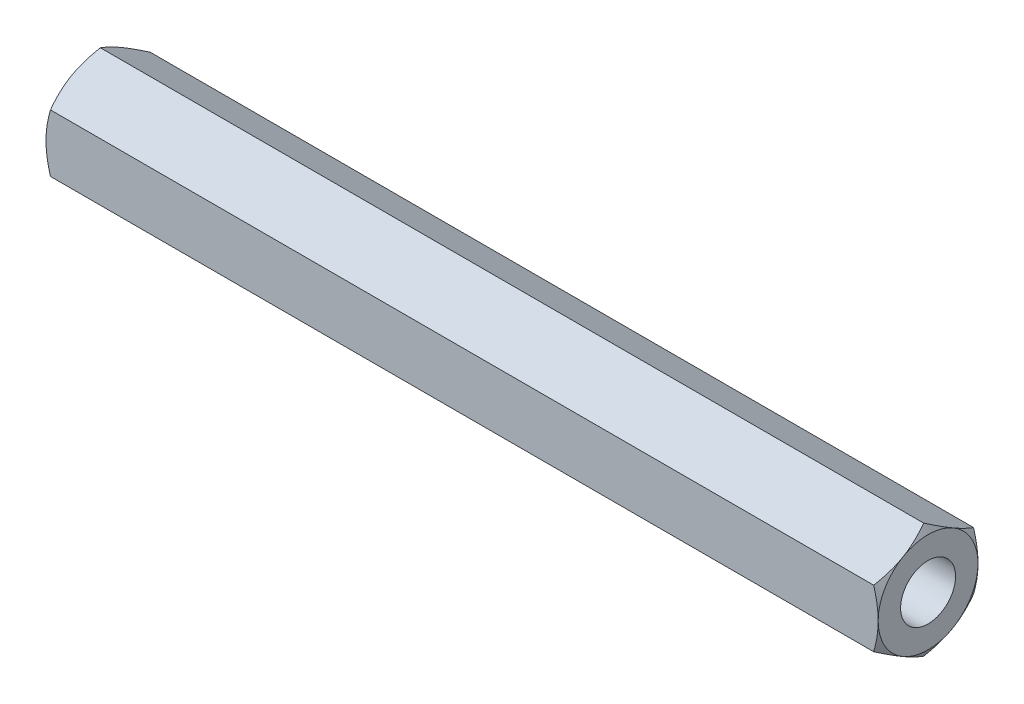
ISO-10303-21;
HEADER;
FILE_DESCRIPTION(('STEP AP214'),'2;1');
FILE_NAME('part.step','',(''),(''),'','','');
FILE_SCHEMA(('AUTOMOTIVE_DESIGN { 1 0 10303 214 1 1 1 1 }'));
ENDSEC;
DATA;
#1=APPLICATION_CONTEXT('core data for automotive mechanical design processes');
#2=APPLICATION_PROTOCOL_DEFINITION('international standard','automotive_design',2000,#1);
#3=PRODUCT_CONTEXT('',#1,'mechanical');
#4=PRODUCT('Part','Part','',(#3));
#5=PRODUCT_RELATED_PRODUCT_CATEGORY('part','',(#4));
#6=PRODUCT_DEFINITION_FORMATION('','',#4);
#7=PRODUCT_DEFINITION_CONTEXT('part definition',#1,'design');
#8=PRODUCT_DEFINITION('design','',#6,#7);
#9=PRODUCT_DEFINITION_SHAPE('','',#8);
#10=(LENGTH_UNIT() NAMED_UNIT(*) SI_UNIT(.MILLI.,.METRE.));
#11=(NAMED_UNIT(*) PLANE_ANGLE_UNIT() SI_UNIT($,.RADIAN.));
#12=(NAMED_UNIT(*) SI_UNIT($,.STERADIAN.) SOLID_ANGLE_UNIT());
#13=UNCERTAINTY_MEASURE_WITH_UNIT(LENGTH_MEASURE(1.E-05),#10,'distance_accuracy_value','');
#14=(GEOMETRIC_REPRESENTATION_CONTEXT(3) GLOBAL_UNCERTAINTY_ASSIGNED_CONTEXT((#13)) GLOBAL_UNIT_ASSIGNED_CONTEXT((#10,
#11,#12)) REPRESENTATION_CONTEXT('',''));
#15=CARTESIAN_POINT('',(0.,0.,0.));
#16=DIRECTION('',(0.,0.,1.));
#17=DIRECTION('',(1.,0.,0.));
#18=AXIS2_PLACEMENT_3D('',#15,#16,#17);
#19=CARTESIAN_POINT('',(50.,-1.73205080756888,3.));
#20=DIRECTION('',(0.,0.866025403784439,-0.499999999999999));
#21=DIRECTION('',(0.,0.499999999999999,0.866025403784439));
#22=AXIS2_PLACEMENT_3D('',#19,#20,#21);
#23=PLANE('',#22);
#24=CARTESIAN_POINT('',(0.268015862431012,-3.4642170851916,-0.000199999999998663));
#25=CARTESIAN_POINT('',(0.224053704452308,-3.38810199317915,0.131635206588334));
#26=CARTESIAN_POINT('',(0.18407158629263,-3.31132988107607,0.264608405355251));
#27=CARTESIAN_POINT('',(0.114282080445467,-3.15645624025988,0.532857420002058));
#28=CARTESIAN_POINT('',(0.0844993822653816,-3.078351959461,0.668138002634344));
#29=CARTESIAN_POINT('',(0.0381378392112558,-2.92311136358059,0.937022602096486));
#30=CARTESIAN_POINT('',(0.0212504411229507,-2.84599893549862,1.07058524542946));
#31=CARTESIAN_POINT('',(0.00108964244852522,-2.6914112001411,1.3383390572957));
#32=CARTESIAN_POINT('',(-0.00220045221891811,-2.61393645482892,1.47252925247985));
#33=CARTESIAN_POINT('',(0.00464053088539217,-2.46916798492017,1.72327559769581));
#34=CARTESIAN_POINT('',(0.0130919141926184,-2.40185259973206,1.83986926497268));
#35=CARTESIAN_POINT('',(0.0398789430070373,-2.2676603930218,2.07229698497464));
#36=CARTESIAN_POINT('',(0.0582237408617146,-2.2007840357172,2.18813023365133));
#37=CARTESIAN_POINT('',(0.10408475085333,-2.06631510305815,2.42103725705637));
#38=CARTESIAN_POINT('',(0.131795385263085,-1.99873954872331,2.53808155051394));
#39=CARTESIAN_POINT('',(0.194687795137403,-1.8645963706076,2.77042435049913));
#40=CARTESIAN_POINT('',(0.229854791021559,-1.79802702797161,2.88572583417111));
#41=CARTESIAN_POINT('',(0.268015862431013,-1.73193533751504,3.0002));
#42=B_SPLINE_CURVE_WITH_KNOTS('',3,(#24,#25,#26,#27,#28,#29,#30,#31,#32,#33,#34,#35,#36,#37,#38,
#39,#40,#41),.UNSPECIFIED.,.F.,.F.,(4,2,2,2,2,2,2,2,4),(0.,0.475539830103042,0.952222784107966,
1.41710776961288,1.88142182298026,2.28572436316091,2.69040156475039,3.10405572063576,
3.5168974940707),.UNSPECIFIED.);
#43=CARTESIAN_POINT('',(0.,-2.59807621135332,1.5));
#44=VERTEX_POINT('',#43);
#45=CARTESIAN_POINT('',(0.267949192431119,-1.73205080756886,3.));
#46=VERTEX_POINT('',#45);
#47=EDGE_CURVE('E225',#44,#46,#42,.T.);
#48=ORIENTED_EDGE('',*,*,#47,.F.);
#49=CARTESIAN_POINT('',(0.267949192431119,-3.46410161513775,0.));
#50=VERTEX_POINT('',#49);
#51=EDGE_CURVE('E339',#50,#44,#42,.T.);
#52=ORIENTED_EDGE('',*,*,#51,.F.);
#53=DIRECTION('',(-1.,0.,0.));
#54=VECTOR('',#53,1.);
#55=CARTESIAN_POINT('',(50.,-3.46410161513776,0.));
#56=LINE('',#55,#54);
#57=CARTESIAN_POINT('',(49.7320508075689,-3.46410161513775,0.));
#58=VERTEX_POINT('',#57);
#59=EDGE_CURVE('E303',#58,#50,#56,.T.);
#60=ORIENTED_EDGE('',*,*,#59,.F.);
#61=CARTESIAN_POINT('',(49.731984137569,-1.73193533751504,3.0002));
#62=CARTESIAN_POINT('',(49.7759462955477,-1.80805042952749,2.86836479341167));
#63=CARTESIAN_POINT('',(49.8159284137074,-1.88482254163057,2.73539159464475));
#64=CARTESIAN_POINT('',(49.8857179195545,-2.03969618244676,2.46714257999795));
#65=CARTESIAN_POINT('',(49.9155006177346,-2.11780046324564,2.33186199736566));
#66=CARTESIAN_POINT('',(49.9618621607887,-2.27304105912605,2.06297739790352));
#67=CARTESIAN_POINT('',(49.978749558877,-2.35015348720802,1.92941475457054));
#68=CARTESIAN_POINT('',(49.9989103575515,-2.50474122256554,1.66166094270431));
#69=CARTESIAN_POINT('',(50.0022004522189,-2.58221596787772,1.52747074752016));
#70=CARTESIAN_POINT('',(49.9953594691146,-2.72698443778647,1.2767244023042));
#71=CARTESIAN_POINT('',(49.9869080858074,-2.79429982297457,1.16013073502733));
#72=CARTESIAN_POINT('',(49.960121056993,-2.92849202968484,0.927703015025365));
#73=CARTESIAN_POINT('',(49.9417762591383,-2.99536838698944,0.811869766348671));
#74=CARTESIAN_POINT('',(49.8959152491467,-3.12983731964849,0.578962742943634));
#75=CARTESIAN_POINT('',(49.8682046147369,-3.19741287398333,0.46191844948606));
#76=CARTESIAN_POINT('',(49.8053122048626,-3.33155605209905,0.229575649500875));
#77=CARTESIAN_POINT('',(49.7701452089784,-3.39812539473503,0.114274165828893));
#78=CARTESIAN_POINT('',(49.731984137569,-3.4642170851916,-0.000199999999999578));
#79=B_SPLINE_CURVE_WITH_KNOTS('',3,(#61,#62,#63,#64,#65,#66,#67,#68,#69,#70,#71,#72,#73,#74,#75,
#76,#77,#78),.UNSPECIFIED.,.F.,.F.,(4,2,2,2,2,2,2,2,4),(0.,0.475539830103041,0.952222784107964,
1.41710776961288,1.88142182298026,2.28572436316091,2.69040156475039,3.10405572063577,
3.51689749407071),.UNSPECIFIED.);
#80=CARTESIAN_POINT('',(50.,-2.59807621135332,1.5));
#81=VERTEX_POINT('',#80);
#82=EDGE_CURVE('E272',#81,#58,#79,.T.);
#83=ORIENTED_EDGE('',*,*,#82,.F.);
#84=CARTESIAN_POINT('',(49.7320508075689,-1.73205080756887,3.));
#85=VERTEX_POINT('',#84);
#86=EDGE_CURVE('E277',#85,#81,#79,.T.);
#87=ORIENTED_EDGE('',*,*,#86,.F.);
#88=DIRECTION('',(-1.,0.,0.));
#89=VECTOR('',#88,1.);
#90=CARTESIAN_POINT('',(50.,-1.73205080756888,3.));
#91=LINE('',#90,#89);
#92=EDGE_CURVE('E342',#85,#46,#91,.T.);
#93=ORIENTED_EDGE('',*,*,#92,.T.);
#94=EDGE_LOOP('',(#48,#52,#60,#83,#87,#93));
#95=FACE_BOUND('',#94,.T.);
#96=ADVANCED_FACE('F47',(#95),#23,.F.);
#97=CARTESIAN_POINT('',(50.,-3.46410161513776,0.));
#98=DIRECTION('',(0.,0.866025403784439,0.499999999999999));
#99=DIRECTION('',(0.,-0.499999999999999,0.866025403784439));
#100=AXIS2_PLACEMENT_3D('',#97,#98,#99);
#101=PLANE('',#100);
#102=CARTESIAN_POINT('',(0.268015862431008,-1.73193533751505,-3.00019999999999));
#103=CARTESIAN_POINT('',(0.224053704452304,-1.80805042952749,-2.86836479341166));
#104=CARTESIAN_POINT('',(0.184071586292626,-1.88482254163058,-2.73539159464474));
#105=CARTESIAN_POINT('',(0.114282080445464,-2.03969618244676,-2.46714257999793));
#106=CARTESIAN_POINT('',(0.0844993822653792,-2.11780046324564,-2.33186199736565));
#107=CARTESIAN_POINT('',(0.038137839211254,-2.27304105912606,-2.06297739790351));
#108=CARTESIAN_POINT('',(0.0212504411229492,-2.35015348720803,-1.92941475457053));
#109=CARTESIAN_POINT('',(0.00108964244852425,-2.50474122256554,-1.6616609427043));
#110=CARTESIAN_POINT('',(-0.00220045221891878,-2.58221596787772,-1.52747074752015));
#111=CARTESIAN_POINT('',(0.0046405308853918,-2.72698443778647,-1.27672440230418));
#112=CARTESIAN_POINT('',(0.013091914192618,-2.79429982297458,-1.16013073502731));
#113=CARTESIAN_POINT('',(0.0398789430070372,-2.92849202968484,-0.927703015025355));
#114=CARTESIAN_POINT('',(0.0582237408617145,-2.99536838698944,-0.811869766348661));
#115=CARTESIAN_POINT('',(0.10408475085333,-3.12983731964849,-0.578962742943627));
#116=CARTESIAN_POINT('',(0.131795385263085,-3.19741287398333,-0.461918449486054));
#117=CARTESIAN_POINT('',(0.194687795137403,-3.33155605209905,-0.229575649500872));
#118=CARTESIAN_POINT('',(0.229854791021558,-3.39812539473503,-0.114274165828891));
#119=CARTESIAN_POINT('',(0.268015862431012,-3.4642170851916,0.00020000000000122));
#120=B_SPLINE_CURVE_WITH_KNOTS('',3,(#102,#103,#104,#105,#106,#107,#108,#109,#110,#111,#112,
#113,#114,#115,#116,#117,#118,#119),.UNSPECIFIED.,.F.,.F.,(4,2,2,2,2,2,2,2,4),(0.,
0.47553983010304,0.952222784107964,1.41710776961288,1.88142182298026,2.28572436316091,
2.69040156475038,3.10405572063575,3.51689749407069),.UNSPECIFIED.);
#121=CARTESIAN_POINT('',(0.,-2.59807621135332,-1.5));
#122=VERTEX_POINT('',#121);
#123=EDGE_CURVE('E237',#122,#50,#120,.T.);
#124=ORIENTED_EDGE('',*,*,#123,.F.);
#125=CARTESIAN_POINT('',(0.267949192431119,-1.73205080756889,-2.99999999999999));
#126=VERTEX_POINT('',#125);
#127=EDGE_CURVE('E243',#126,#122,#120,.T.);
#128=ORIENTED_EDGE('',*,*,#127,.F.);
#129=DIRECTION('',(-1.,0.,0.));
#130=VECTOR('',#129,1.);
#131=CARTESIAN_POINT('',(50.,-1.73205080756889,-2.99999999999999));
#132=LINE('',#131,#130);
#133=CARTESIAN_POINT('',(49.7320508075689,-1.73205080756889,-2.99999999999999));
#134=VERTEX_POINT('',#133);
#135=EDGE_CURVE('E298',#134,#126,#132,.T.);
#136=ORIENTED_EDGE('',*,*,#135,.F.);
#137=CARTESIAN_POINT('',(49.731984137569,-3.4642170851916,0.000200000000002223));
#138=CARTESIAN_POINT('',(49.7759462955477,-3.38810199317915,-0.13163520658833));
#139=CARTESIAN_POINT('',(49.8159284137074,-3.31132988107607,-0.264608405355247));
#140=CARTESIAN_POINT('',(49.8857179195545,-3.15645624025988,-0.532857420002053));
#141=CARTESIAN_POINT('',(49.9155006177346,-3.078351959461,-0.668138002634339));
#142=CARTESIAN_POINT('',(49.9618621607887,-2.92311136358059,-0.93702260209648));
#143=CARTESIAN_POINT('',(49.978749558877,-2.84599893549862,-1.07058524542946));
#144=CARTESIAN_POINT('',(49.9989103575515,-2.6914112001411,-1.33833905729569));
#145=CARTESIAN_POINT('',(50.0022004522189,-2.61393645482892,-1.47252925247984));
#146=CARTESIAN_POINT('',(49.9953594691146,-2.46916798492017,-1.7232755976958));
#147=CARTESIAN_POINT('',(49.9869080858074,-2.40185259973207,-1.83986926497267));
#148=CARTESIAN_POINT('',(49.960121056993,-2.26766039302181,-2.07229698497463));
#149=CARTESIAN_POINT('',(49.9417762591383,-2.20078403571721,-2.18813023365133));
#150=CARTESIAN_POINT('',(49.8959152491467,-2.06631510305816,-2.42103725705636));
#151=CARTESIAN_POINT('',(49.8682046147369,-1.99873954872332,-2.53808155051393));
#152=CARTESIAN_POINT('',(49.8053122048626,-1.8645963706076,-2.77042435049912));
#153=CARTESIAN_POINT('',(49.7701452089784,-1.79802702797162,-2.8857258341711));
#154=CARTESIAN_POINT('',(49.731984137569,-1.73193533751505,-3.00019999999999));
#155=B_SPLINE_CURVE_WITH_KNOTS('',3,(#137,#138,#139,#140,#141,#142,#143,#144,#145,#146,#147,
#148,#149,#150,#151,#152,#153,#154),.UNSPECIFIED.,.F.,.F.,(4,2,2,2,2,2,2,2,4),(0.,
0.47553983010304,0.952222784107964,1.41710776961288,1.88142182298026,2.28572436316091,
2.69040156475038,3.10405572063576,3.51689749407069),.UNSPECIFIED.);
#156=CARTESIAN_POINT('',(50.,-2.59807621135332,-1.5));
#157=VERTEX_POINT('',#156);
#158=EDGE_CURVE('E259',#157,#134,#155,.T.);
#159=ORIENTED_EDGE('',*,*,#158,.F.);
#160=EDGE_CURVE('E265',#58,#157,#155,.T.);
#161=ORIENTED_EDGE('',*,*,#160,.F.);
#162=ORIENTED_EDGE('',*,*,#59,.T.);
#163=EDGE_LOOP('',(#124,#128,#136,#159,#161,#162));
#164=FACE_BOUND('',#163,.T.);
#165=ADVANCED_FACE('F251',(#164),#101,.F.);
#166=CARTESIAN_POINT('',(50.,-1.73205080756889,-2.99999999999999));
#167=DIRECTION('',(0.,0.,1.));
#168=DIRECTION('',(0.,-1.,0.));
#169=AXIS2_PLACEMENT_3D('',#166,#167,#168);
#170=PLANE('',#169);
#171=CARTESIAN_POINT('',(1.43558063355249,-4.5936550632739,-2.99999999999999));
#172=CARTESIAN_POINT('',(1.37192769854955,-4.46193806193921,-2.99999999999999));
#173=CARTESIAN_POINT('',(1.3089075261953,-4.32990963818021,-2.99999999999999));
#174=CARTESIAN_POINT('',(1.18449428928628,-4.06506155981042,-2.99999999999999));
#175=CARTESIAN_POINT('',(1.12310150644712,-3.93224177301897,-2.99999999999999));
#176=CARTESIAN_POINT('',(1.00198121042108,-3.66492510058907,-2.99999999999999));
#177=CARTESIAN_POINT('',(0.942265237401318,-3.53042296718751,-2.99999999999999));
#178=CARTESIAN_POINT('',(0.825398236528266,-3.26031321099484,-2.99999999999999));
#179=CARTESIAN_POINT('',(0.768247074976145,-3.12470564626428,-2.99999999999999));
#180=CARTESIAN_POINT('',(0.656513220776866,-2.85048588685443,-2.99999999999999));
#181=CARTESIAN_POINT('',(0.601970674908428,-2.71185724371338,-2.99999999999999));
#182=CARTESIAN_POINT('',(0.49715734367469,-2.43296482040768,-2.99999999999999));
#183=CARTESIAN_POINT('',(0.446887033573552,-2.29270086029106,-2.99999999999999));
#184=CARTESIAN_POINT('',(0.351968923605783,-2.01060273748632,-2.99999999999999));
#185=CARTESIAN_POINT('',(0.307309170304389,-1.86877263831547,-2.99999999999999));
#186=CARTESIAN_POINT('',(0.225062578549613,-1.5830961389059,-2.99999999999999));
#187=CARTESIAN_POINT('',(0.187473503387639,-1.43925039181264,-2.99999999999999));
#188=CARTESIAN_POINT('',(0.121193111976194,-1.14944432791498,-2.99999999999999));
#189=CARTESIAN_POINT('',(0.0925041661926663,-1.00348345858388,-2.99999999999999));
#190=CARTESIAN_POINT('',(0.0459556604077279,-0.709801932641903,-2.99999999999999));
#191=CARTESIAN_POINT('',(0.0280961099738148,-0.562081274476403,-2.99999999999999));
#192=CARTESIAN_POINT('',(0.00478634221370155,-0.266588683448616,-2.99999999999999));
#193=CARTESIAN_POINT('',(-0.000742435968470097,-0.118823109094487,-2.99999999999999));
#194=CARTESIAN_POINT('',(0.000903065061568725,0.176604568225066,-2.99999999999998));
#195=CARTESIAN_POINT('',(0.0080740468219427,0.324266688093653,-2.99999999999998));
#196=CARTESIAN_POINT('',(0.0306591215677418,0.576421127047397,-2.99999999999998));
#197=CARTESIAN_POINT('',(0.0431320574085226,0.681191633058682,-2.99999999999998));
#198=CARTESIAN_POINT('',(0.0736601734850352,0.889923323753434,-2.99999999999998));
#199=CARTESIAN_POINT('',(0.0917162341003719,0.993884378145506,-2.99999999999998));
#200=CARTESIAN_POINT('',(0.15331148164255,1.30446861725753,-2.99999999999998));
#201=CARTESIAN_POINT('',(0.204261875138217,1.50963598921605,-2.99999999999998));
#202=CARTESIAN_POINT('',(0.292137526979816,1.8166377585116,-2.99999999999998));
#203=CARTESIAN_POINT('',(0.323785729688481,1.9200724007783,-2.99999999999998));
#204=CARTESIAN_POINT('',(0.390213739719305,2.12586210546061,-2.99999999999998));
#205=CARTESIAN_POINT('',(0.424991387069349,2.22821785884626,-2.99999999999998));
#206=CARTESIAN_POINT('',(0.496954624473532,2.43142176673502,-2.99999999999998));
#207=CARTESIAN_POINT('',(0.534125559182345,2.5322751641883,-2.99999999999998));
#208=CARTESIAN_POINT('',(0.610649159322931,2.73319947171952,-2.99999999999998));
#209=CARTESIAN_POINT('',(0.650002706536684,2.83327004662892,-2.99999999999998));
#210=CARTESIAN_POINT('',(0.690232177334533,2.93297878902283,-2.99999999999998));
#211=B_SPLINE_CURVE_WITH_KNOTS('',3,(#171,#172,#173,#174,#175,#176,#177,#178,#179,#180,#181,
#182,#183,#184,#185,#186,#187,#188,#189,#190,#191,#192,#193,#194,#195,#196,#197,#198,#199,#200,
#201,#202,#203,#204,#205,#206,#207,#208,#209,#210),.UNSPECIFIED.,.F.,.F.,(4,2,2,2,2,2,2,2,2,2,2,
2,2,2,2,2,2,2,2,4),(0.,0.438878972321587,0.877833428815442,1.31929984513467,1.76074322183933,
2.20760615360299,2.65451873166517,3.10046239380698,3.54626474989472,3.99218573952054,
4.43810712310573,4.88117927184296,5.32413639518722,5.64051293969398,5.95693939775843,
6.59026325136604,6.91474174356255,7.23899797076879,7.56142906579427,7.88399138651427),.UNSPECIFIED.);
#212=CARTESIAN_POINT('',(0.,0.,-3.));
#213=VERTEX_POINT('',#212);
#214=EDGE_CURVE('E244',#213,#126,#211,.F.);
#215=ORIENTED_EDGE('',*,*,#214,.F.);
#216=CARTESIAN_POINT('',(0.267949192431119,1.73205080756888,-2.99999999999999));
#217=VERTEX_POINT('',#216);
#218=EDGE_CURVE('E351',#217,#213,#211,.F.);
#219=ORIENTED_EDGE('',*,*,#218,.F.);
#220=DIRECTION('',(-1.,0.,0.));
#221=VECTOR('',#220,1.);
#222=CARTESIAN_POINT('',(50.,1.73205080756889,-2.99999999999998));
#223=LINE('',#222,#221);
#224=CARTESIAN_POINT('',(49.7320508075689,1.73205080756888,-2.99999999999999));
#225=VERTEX_POINT('',#224);
#226=EDGE_CURVE('E304',#225,#217,#223,.T.);
#227=ORIENTED_EDGE('',*,*,#226,.F.);
#228=CARTESIAN_POINT('',(48.5644193664475,-4.59365506327389,-2.99999999999999));
#229=CARTESIAN_POINT('',(48.6280723014505,-4.46193806193921,-2.99999999999999));
#230=CARTESIAN_POINT('',(48.6910924738047,-4.32990963818021,-2.99999999999999));
#231=CARTESIAN_POINT('',(48.8155057107137,-4.06506155981041,-2.99999999999999));
#232=CARTESIAN_POINT('',(48.8768984935529,-3.93224177301896,-2.99999999999999));
#233=CARTESIAN_POINT('',(48.9980187895789,-3.66492510058907,-2.99999999999999));
#234=CARTESIAN_POINT('',(49.0577347625987,-3.5304229671875,-2.99999999999999));
#235=CARTESIAN_POINT('',(49.1746017634717,-3.26031321099483,-2.99999999999999));
#236=CARTESIAN_POINT('',(49.2317529250239,-3.12470564626427,-2.99999999999999));
#237=CARTESIAN_POINT('',(49.3434867792231,-2.85048588685443,-2.99999999999999));
#238=CARTESIAN_POINT('',(49.3980293250916,-2.71185724371337,-2.99999999999999));
#239=CARTESIAN_POINT('',(49.5028426563253,-2.43296482040768,-2.99999999999999));
#240=CARTESIAN_POINT('',(49.5531129664265,-2.29270086029106,-2.99999999999999));
#241=CARTESIAN_POINT('',(49.6480310763942,-2.01060273748632,-2.99999999999999));
#242=CARTESIAN_POINT('',(49.6926908296956,-1.86877263831547,-2.99999999999999));
#243=CARTESIAN_POINT('',(49.7749374214504,-1.5830961389059,-2.99999999999999));
#244=CARTESIAN_POINT('',(49.8125264966124,-1.43925039181264,-2.99999999999999));
#245=CARTESIAN_POINT('',(49.8788068880238,-1.14944432791498,-2.99999999999999));
#246=CARTESIAN_POINT('',(49.9074958338073,-1.00348345858388,-2.99999999999999));
#247=CARTESIAN_POINT('',(49.9540443395923,-0.709801932641903,-2.99999999999999));
#248=CARTESIAN_POINT('',(49.9719038900262,-0.562081274476404,-2.99999999999999));
#249=CARTESIAN_POINT('',(49.9952136577863,-0.266588683448618,-2.99999999999999));
#250=CARTESIAN_POINT('',(50.0007424359685,-0.118823109094489,-2.99999999999999));
#251=CARTESIAN_POINT('',(49.9990969349384,0.176604568225062,-2.99999999999998));
#252=CARTESIAN_POINT('',(49.9919259531781,0.32426668809365,-2.99999999999998));
#253=CARTESIAN_POINT('',(49.9693408784323,0.576421127047393,-2.99999999999998));
#254=CARTESIAN_POINT('',(49.9568679425915,0.68119163305868,-2.99999999999998));
#255=CARTESIAN_POINT('',(49.926339826515,0.889923323753433,-2.99999999999998));
#256=CARTESIAN_POINT('',(49.9082837658996,0.993884378145507,-2.99999999999998));
#257=CARTESIAN_POINT('',(49.8466885183575,1.30446861725753,-2.99999999999998));
#258=CARTESIAN_POINT('',(49.7957381248618,1.50963598921606,-2.99999999999998));
#259=CARTESIAN_POINT('',(49.7078624730202,1.81663775851161,-2.99999999999998));
#260=CARTESIAN_POINT('',(49.6762142703115,1.92007240077832,-2.99999999999998));
#261=CARTESIAN_POINT('',(49.6097862602807,2.12586210546063,-2.99999999999998));
#262=CARTESIAN_POINT('',(49.5750086129307,2.22821785884628,-2.99999999999998));
#263=CARTESIAN_POINT('',(49.5030453755265,2.43142176673504,-2.99999999999998));
#264=CARTESIAN_POINT('',(49.4658744408177,2.53227516418832,-2.99999999999998));
#265=CARTESIAN_POINT('',(49.3893508406771,2.73319947171955,-2.99999999999998));
#266=CARTESIAN_POINT('',(49.3499972934633,2.83327004662895,-2.99999999999998));
#267=CARTESIAN_POINT('',(49.3097678226655,2.93297878902286,-2.99999999999998));
#268=B_SPLINE_CURVE_WITH_KNOTS('',3,(#228,#229,#230,#231,#232,#233,#234,#235,#236,#237,#238,
#239,#240,#241,#242,#243,#244,#245,#246,#247,#248,#249,#250,#251,#252,#253,#254,#255,#256,#257,
#258,#259,#260,#261,#262,#263,#264,#265,#266,#267),.UNSPECIFIED.,.F.,.F.,(4,2,2,2,2,2,2,2,2,2,2,
2,2,2,2,2,2,2,2,4),(0.,0.438878972321586,0.877833428815437,1.31929984513466,1.76074322183933,
2.20760615360298,2.65451873166515,3.10046239380697,3.54626474989471,3.99218573952053,
4.43810712310571,4.88117927184294,5.3241363951872,5.64051293969397,5.95693939775841,
6.59026325136604,6.91474174356256,7.2389979707688,7.56142906579428,7.88399138651428),.UNSPECIFIED.);
#269=CARTESIAN_POINT('',(50.,0.,-3.));
#270=VERTEX_POINT('',#269);
#271=EDGE_CURVE('E267',#270,#225,#268,.T.);
#272=ORIENTED_EDGE('',*,*,#271,.F.);
#273=EDGE_CURVE('E266',#134,#270,#268,.T.);
#274=ORIENTED_EDGE('',*,*,#273,.F.);
#275=ORIENTED_EDGE('',*,*,#135,.T.);
#276=EDGE_LOOP('',(#215,#219,#227,#272,#274,#275));
#277=FACE_BOUND('',#276,.T.);
#278=ADVANCED_FACE('F254',(#277),#170,.F.);
#279=CARTESIAN_POINT('',(50.,1.73205080756889,-2.99999999999998));
#280=DIRECTION('',(0.,-0.866025403784438,0.5));
#281=DIRECTION('',(0.,-0.5,-0.866025403784438));
#282=AXIS2_PLACEMENT_3D('',#279,#280,#281);
#283=PLANE('',#282);
#284=CARTESIAN_POINT('',(0.268015862431008,3.46421708519159,0.000199999999986678));
#285=CARTESIAN_POINT('',(0.224053704452304,3.38810199317914,-0.131635206588345));
#286=CARTESIAN_POINT('',(0.184071586292626,3.31132988107606,-0.264608405355262));
#287=CARTESIAN_POINT('',(0.114282080445464,3.15645624025987,-0.532857420002069));
#288=CARTESIAN_POINT('',(0.0844993822653787,3.07835195946099,-0.668138002634355));
#289=CARTESIAN_POINT('',(0.0381378392112535,2.92311136358058,-0.937022602096496));
#290=CARTESIAN_POINT('',(0.0212504411229487,2.84599893549861,-1.07058524542947));
#291=CARTESIAN_POINT('',(0.00108964244852383,2.69141120014109,-1.3383390572957));
#292=CARTESIAN_POINT('',(-0.0022004522189192,2.61393645482891,-1.47252925247986));
#293=CARTESIAN_POINT('',(0.0046405308853912,2.46916798492016,-1.72327559769582));
#294=CARTESIAN_POINT('',(0.0130919141926171,2.40185259973206,-1.83986926497268));
#295=CARTESIAN_POINT('',(0.0398789430070354,2.2676603930218,-2.07229698497464));
#296=CARTESIAN_POINT('',(0.0582237408617123,2.2007840357172,-2.18813023365133));
#297=CARTESIAN_POINT('',(0.104084750853326,2.06631510305815,-2.42103725705636));
#298=CARTESIAN_POINT('',(0.131795385263081,1.99873954872331,-2.53808155051393));
#299=CARTESIAN_POINT('',(0.194687795137397,1.8645963706076,-2.77042435049911));
#300=CARTESIAN_POINT('',(0.229854791021552,1.79802702797162,-2.88572583417109));
#301=CARTESIAN_POINT('',(0.268015862431005,1.73193533751505,-3.00019999999998));
#302=B_SPLINE_CURVE_WITH_KNOTS('',3,(#284,#285,#286,#287,#288,#289,#290,#291,#292,#293,#294,
#295,#296,#297,#298,#299,#300,#301),.UNSPECIFIED.,.F.,.F.,(4,2,2,2,2,2,2,2,4),(0.,
0.475539830103041,0.952222784107964,1.41710776961288,1.88142182298026,2.2857243631609,
2.69040156475037,3.10405572063574,3.51689749407067),.UNSPECIFIED.);
#303=CARTESIAN_POINT('',(0.,2.59807621135332,-1.5));
#304=VERTEX_POINT('',#303);
#305=EDGE_CURVE('E348',#304,#217,#302,.T.);
#306=ORIENTED_EDGE('',*,*,#305,.F.);
#307=CARTESIAN_POINT('',(0.267949192431119,3.46410161513775,0.));
#308=VERTEX_POINT('',#307);
#309=EDGE_CURVE('E231',#308,#304,#302,.T.);
#310=ORIENTED_EDGE('',*,*,#309,.F.);
#311=DIRECTION('',(-1.,0.,0.));
#312=VECTOR('',#311,1.);
#313=CARTESIAN_POINT('',(50.,3.46410161513775,0.));
#314=LINE('',#313,#312);
#315=CARTESIAN_POINT('',(49.7320508075689,3.46410161513775,0.));
#316=VERTEX_POINT('',#315);
#317=EDGE_CURVE('E308',#316,#308,#314,.T.);
#318=ORIENTED_EDGE('',*,*,#317,.F.);
#319=CARTESIAN_POINT('',(49.731984137569,1.73193533751505,-3.00019999999998));
#320=CARTESIAN_POINT('',(49.7759462955477,1.80805042952749,-2.86836479341165));
#321=CARTESIAN_POINT('',(49.8159284137074,1.88482254163058,-2.73539159464474));
#322=CARTESIAN_POINT('',(49.8857179195545,2.03969618244676,-2.46714257999793));
#323=CARTESIAN_POINT('',(49.9155006177346,2.11780046324564,-2.33186199736564));
#324=CARTESIAN_POINT('',(49.9618621607887,2.27304105912606,-2.0629773979035));
#325=CARTESIAN_POINT('',(49.978749558877,2.35015348720803,-1.92941475457053));
#326=CARTESIAN_POINT('',(49.9989103575515,2.50474122256554,-1.6616609427043));
#327=CARTESIAN_POINT('',(50.0022004522189,2.58221596787772,-1.52747074752015));
#328=CARTESIAN_POINT('',(49.9953594691146,2.72698443778647,-1.27672440230418));
#329=CARTESIAN_POINT('',(49.9869080858074,2.79429982297458,-1.16013073502732));
#330=CARTESIAN_POINT('',(49.960121056993,2.92849202968484,-0.927703015025361));
#331=CARTESIAN_POINT('',(49.9417762591383,2.99536838698944,-0.811869766348668));
#332=CARTESIAN_POINT('',(49.8959152491467,3.12983731964849,-0.578962742943636));
#333=CARTESIAN_POINT('',(49.8682046147369,3.19741287398332,-0.461918449486064));
#334=CARTESIAN_POINT('',(49.8053122048626,3.33155605209904,-0.229575649500885));
#335=CARTESIAN_POINT('',(49.7701452089784,3.39812539473502,-0.114274165828905));
#336=CARTESIAN_POINT('',(49.731984137569,3.46421708519159,0.000199999999986781));
#337=B_SPLINE_CURVE_WITH_KNOTS('',3,(#319,#320,#321,#322,#323,#324,#325,#326,#327,#328,#329,
#330,#331,#332,#333,#334,#335,#336),.UNSPECIFIED.,.F.,.F.,(4,2,2,2,2,2,2,2,4),(0.,
0.475539830103039,0.952222784107961,1.41710776961287,1.88142182298025,2.2857243631609,
2.69040156475037,3.10405572063573,3.51689749407067),.UNSPECIFIED.);
#338=CARTESIAN_POINT('',(50.,2.59807621135332,-1.5));
#339=VERTEX_POINT('',#338);
#340=EDGE_CURVE('E364',#339,#316,#337,.T.);
#341=ORIENTED_EDGE('',*,*,#340,.F.);
#342=EDGE_CURVE('E365',#225,#339,#337,.T.);
#343=ORIENTED_EDGE('',*,*,#342,.F.);
#344=ORIENTED_EDGE('',*,*,#226,.T.);
#345=EDGE_LOOP('',(#306,#310,#318,#341,#343,#344));
#346=FACE_BOUND('',#345,.T.);
#347=ADVANCED_FACE('F362',(#346),#283,.F.);
#348=CARTESIAN_POINT('',(50.,3.46410161513775,0.));
#349=DIRECTION('',(0.,-0.866025403784439,-0.5));
#350=DIRECTION('',(0.,0.5,-0.866025403784439));
#351=AXIS2_PLACEMENT_3D('',#348,#349,#350);
#352=PLANE('',#351);
#353=CARTESIAN_POINT('',(0.268015862431008,1.73193533751503,3.0002));
#354=CARTESIAN_POINT('',(0.224053704452304,1.80805042952747,2.86836479341167));
#355=CARTESIAN_POINT('',(0.184071586292626,1.88482254163056,2.73539159464475));
#356=CARTESIAN_POINT('',(0.114282080445462,2.03969618244674,2.46714257999795));
#357=CARTESIAN_POINT('',(0.084499382265376,2.11780046324562,2.33186199736566));
#358=CARTESIAN_POINT('',(0.0381378392112495,2.27304105912603,2.06297739790352));
#359=CARTESIAN_POINT('',(0.0212504411229441,2.350153487208,1.92941475457054));
#360=CARTESIAN_POINT('',(0.00108964244851772,2.50474122256552,1.66166094270431));
#361=CARTESIAN_POINT('',(-0.00220045221892613,2.5822159678777,1.52747074752016));
#362=CARTESIAN_POINT('',(0.00464053088538316,2.72698443778645,1.2767244023042));
#363=CARTESIAN_POINT('',(0.0130919141926091,2.79429982297456,1.16013073502733));
#364=CARTESIAN_POINT('',(0.0398789430070281,2.92849202968482,0.927703015025362));
#365=CARTESIAN_POINT('',(0.0582237408617056,2.99536838698942,0.811869766348665));
#366=CARTESIAN_POINT('',(0.104084750853321,3.12983731964848,0.578962742943626));
#367=CARTESIAN_POINT('',(0.131795385263077,3.19741287398332,0.461918449486051));
#368=CARTESIAN_POINT('',(0.194687795137397,3.33155605209904,0.229575649500865));
#369=CARTESIAN_POINT('',(0.229854791021553,3.39812539473502,0.114274165828882));
#370=CARTESIAN_POINT('',(0.268015862431008,3.46421708519159,-0.000200000000013592));
#371=B_SPLINE_CURVE_WITH_KNOTS('',3,(#353,#354,#355,#356,#357,#358,#359,#360,#361,#362,#363,
#364,#365,#366,#367,#368,#369,#370),.UNSPECIFIED.,.F.,.F.,(4,2,2,2,2,2,2,2,4),(0.,
0.47553983010304,0.952222784107964,1.41710776961288,1.88142182298026,2.28572436316091,
2.6904015647504,3.10405572063578,3.51689749407072),.UNSPECIFIED.);
#372=CARTESIAN_POINT('',(0.,2.59807621135332,1.5));
#373=VERTEX_POINT('',#372);
#374=EDGE_CURVE('E343',#373,#308,#371,.T.);
#375=ORIENTED_EDGE('',*,*,#374,.F.);
#376=CARTESIAN_POINT('',(0.267949192431119,1.73205080756886,3.));
#377=VERTEX_POINT('',#376);
#378=EDGE_CURVE('E206',#377,#373,#371,.T.);
#379=ORIENTED_EDGE('',*,*,#378,.F.);
#380=DIRECTION('',(-1.,0.,0.));
#381=VECTOR('',#380,1.);
#382=CARTESIAN_POINT('',(50.,1.73205080756886,3.));
#383=LINE('',#382,#381);
#384=CARTESIAN_POINT('',(49.7320508075689,1.73205080756887,3.));
#385=VERTEX_POINT('',#384);
#386=EDGE_CURVE('E353',#385,#377,#383,.T.);
#387=ORIENTED_EDGE('',*,*,#386,.F.);
#388=CARTESIAN_POINT('',(49.731984137569,3.46421708519159,-0.000200000000013524));
#389=CARTESIAN_POINT('',(49.7759462955477,3.38810199317914,0.131635206588318));
#390=CARTESIAN_POINT('',(49.8159284137074,3.31132988107606,0.264608405355236));
#391=CARTESIAN_POINT('',(49.8857179195545,3.15645624025987,0.532857420002042));
#392=CARTESIAN_POINT('',(49.9155006177346,3.078351959461,0.668138002634327));
#393=CARTESIAN_POINT('',(49.9618621607888,2.92311136358058,0.937022602096468));
#394=CARTESIAN_POINT('',(49.9787495588771,2.84599893549861,1.07058524542944));
#395=CARTESIAN_POINT('',(49.9989103575515,2.69141120014109,1.33833905729568));
#396=CARTESIAN_POINT('',(50.0022004522189,2.61393645482892,1.47252925247983));
#397=CARTESIAN_POINT('',(49.9953594691146,2.46916798492016,1.72327559769579));
#398=CARTESIAN_POINT('',(49.9869080858074,2.40185259973206,1.83986926497266));
#399=CARTESIAN_POINT('',(49.960121056993,2.26766039302179,2.07229698497463));
#400=CARTESIAN_POINT('',(49.9417762591383,2.20078403571719,2.18813023365132));
#401=CARTESIAN_POINT('',(49.8959152491467,2.06631510305814,2.42103725705636));
#402=CARTESIAN_POINT('',(49.8682046147369,1.9987395487233,2.53808155051394));
#403=CARTESIAN_POINT('',(49.8053122048626,1.86459637060758,2.77042435049912));
#404=CARTESIAN_POINT('',(49.7701452089785,1.7980270279716,2.88572583417111));
#405=CARTESIAN_POINT('',(49.731984137569,1.73193533751503,3.0002));
#406=B_SPLINE_CURVE_WITH_KNOTS('',3,(#388,#389,#390,#391,#392,#393,#394,#395,#396,#397,#398,
#399,#400,#401,#402,#403,#404,#405),.UNSPECIFIED.,.F.,.F.,(4,2,2,2,2,2,2,2,4),(0.,
0.475539830103041,0.952222784107964,1.41710776961288,1.88142182298025,2.28572436316091,
2.6904015647504,3.10405572063578,3.51689749407072),.UNSPECIFIED.);
#407=CARTESIAN_POINT('',(50.,2.59807621135332,1.5));
#408=VERTEX_POINT('',#407);
#409=EDGE_CURVE('E171',#408,#385,#406,.T.);
#410=ORIENTED_EDGE('',*,*,#409,.F.);
#411=EDGE_CURVE('E359',#316,#408,#406,.T.);
#412=ORIENTED_EDGE('',*,*,#411,.F.);
#413=ORIENTED_EDGE('',*,*,#317,.T.);
#414=EDGE_LOOP('',(#375,#379,#387,#410,#412,#413));
#415=FACE_BOUND('',#414,.T.);
#416=ADVANCED_FACE('F187',(#415),#352,.F.);
#417=CARTESIAN_POINT('',(50.,1.73205080756886,3.));
#418=DIRECTION('',(0.,0.,-1.));
#419=DIRECTION('',(-1.,0.,0.));
#420=AXIS2_PLACEMENT_3D('',#417,#418,#419);
#421=PLANE('',#420);
#422=CARTESIAN_POINT('',(1.43558011593048,-4.5936539924692,3.));
#423=CARTESIAN_POINT('',(1.37192720307518,-4.46193702779008,3.));
#424=CARTESIAN_POINT('',(1.30890705285555,-4.32990864071465,3.));
#425=CARTESIAN_POINT('',(1.18449386009788,-4.06506063583466,3.));
#426=CARTESIAN_POINT('',(1.12310109927543,-3.93224088584946,3.));
#427=CARTESIAN_POINT('',(1.00198084729392,-3.66492428764751,3.));
#428=CARTESIAN_POINT('',(0.942264896297281,-3.53042219167022,3.));
#429=CARTESIAN_POINT('',(0.825397939065225,-3.26031251060448,3.));
#430=CARTESIAN_POINT('',(0.768246799131017,-3.12470498357653,3.));
#431=CARTESIAN_POINT('',(0.656512987795773,-2.85048530058733,3.));
#432=CARTESIAN_POINT('',(0.601970463161885,-2.71185669617078,3.));
#433=CARTESIAN_POINT('',(0.497157173219566,-2.43296435096227,3.));
#434=CARTESIAN_POINT('',(0.446886883174879,-2.29270043021851,3.));
#435=CARTESIAN_POINT('',(0.351968811323162,-2.01060238690328,3.));
#436=CARTESIAN_POINT('',(0.307309076087879,-1.86877232784637,3.));
#437=CARTESIAN_POINT('',(0.225062517408381,-1.58309590976889,3.));
#438=CARTESIAN_POINT('',(0.187473457257565,-1.43925020389312,3.));
#439=CARTESIAN_POINT('',(0.121193096215532,-1.1494442452365,3.));
#440=CARTESIAN_POINT('',(0.0925041644674053,-1.00348344023737,3.));
#441=CARTESIAN_POINT('',(0.0459556769417577,-0.709802044404418,3.));
#442=CARTESIAN_POINT('',(0.0280961307387744,-0.562081452014832,3.));
#443=CARTESIAN_POINT('',(0.00478635986207732,-0.266588992220959,3.));
#444=CARTESIAN_POINT('',(-0.000742425570781044,-0.11882348332051,3.));
#445=CARTESIAN_POINT('',(0.000903049781096691,0.1766040642056,3.));
#446=CARTESIAN_POINT('',(0.0080740131115132,0.324266119734153,3.));
#447=CARTESIAN_POINT('',(0.0306590509601933,0.576420476419137,3.));
#448=CARTESIAN_POINT('',(0.0431319720329325,0.681190963786364,3.));
#449=CARTESIAN_POINT('',(0.0736600577600191,0.889922617976229,3.));
#450=CARTESIAN_POINT('',(0.0917161027938351,0.993883654507599,3.));
#451=CARTESIAN_POINT('',(0.153311303212674,1.30446784089727,3.));
#452=CARTESIAN_POINT('',(0.204261664818866,1.50963517896542,3.));
#453=CARTESIAN_POINT('',(0.292137269487904,1.81663689760893,3.));
#454=CARTESIAN_POINT('',(0.323785456358728,1.92007152271154,3.));
#455=CARTESIAN_POINT('',(0.390213435170823,2.12586119326053,3.));
#456=CARTESIAN_POINT('',(0.424991067140185,2.22821692967668,3.));
#457=CARTESIAN_POINT('',(0.496954274385216,2.43142080387256,3.));
#458=CARTESIAN_POINT('',(0.534125194315126,2.53227418460129,3.));
#459=CARTESIAN_POINT('',(0.610648765343028,2.73319845864686,3.));
#460=CARTESIAN_POINT('',(0.650002298222529,2.83326901679541,3.));
#461=CARTESIAN_POINT('',(0.690231754906346,2.93297774240013,3.));
#462=B_SPLINE_CURVE_WITH_KNOTS('',3,(#422,#423,#424,#425,#426,#427,#428,#429,#430,#431,#432,
#433,#434,#435,#436,#437,#438,#439,#440,#441,#442,#443,#444,#445,#446,#447,#448,#449,#450,#451,
#452,#453,#454,#455,#456,#457,#458,#459,#460,#461),.UNSPECIFIED.,.F.,.F.,(4,2,2,2,2,2,2,2,2,2,2,
2,2,2,2,2,2,2,2,4),(0.,0.438878844399204,0.877833172949452,1.31929945984492,1.7607427071362,
2.20760550748113,2.65451795408017,3.10046148523201,3.54626371043604,3.99218450300884,
4.4381056898311,4.88117764390528,5.32413457244915,5.64051105619142,5.9569374534813,
6.59026118519873,6.91473961423268,7.23899577837224,7.56142681097228,7.88398906914352),.UNSPECIFIED.);
#463=CARTESIAN_POINT('',(0.,0.,3.));
#464=VERTEX_POINT('',#463);
#465=EDGE_CURVE('E195',#464,#377,#462,.T.);
#466=ORIENTED_EDGE('',*,*,#465,.F.);
#467=EDGE_CURVE('E203',#46,#464,#462,.T.);
#468=ORIENTED_EDGE('',*,*,#467,.F.);
#469=ORIENTED_EDGE('',*,*,#92,.F.);
#470=CARTESIAN_POINT('',(48.5644198840695,-4.59365399246919,3.));
#471=CARTESIAN_POINT('',(48.6280727969248,-4.46193702779007,3.));
#472=CARTESIAN_POINT('',(48.6910929471445,-4.32990864071464,3.));
#473=CARTESIAN_POINT('',(48.8155061399021,-4.06506063583466,3.));
#474=CARTESIAN_POINT('',(48.8768989007246,-3.93224088584945,3.));
#475=CARTESIAN_POINT('',(48.9980191527061,-3.6649242876475,3.));
#476=CARTESIAN_POINT('',(49.0577351037027,-3.53042219167022,3.));
#477=CARTESIAN_POINT('',(49.1746020609348,-3.26031251060447,3.));
#478=CARTESIAN_POINT('',(49.231753200869,-3.12470498357653,3.));
#479=CARTESIAN_POINT('',(49.3434870122042,-2.85048530058733,3.));
#480=CARTESIAN_POINT('',(49.3980295368381,-2.71185669617077,3.));
#481=CARTESIAN_POINT('',(49.5028428267804,-2.43296435096226,3.));
#482=CARTESIAN_POINT('',(49.5531131168251,-2.29270043021851,3.));
#483=CARTESIAN_POINT('',(49.6480311886768,-2.01060238690328,3.));
#484=CARTESIAN_POINT('',(49.6926909239121,-1.86877232784636,3.));
#485=CARTESIAN_POINT('',(49.7749374825916,-1.58309590976888,3.));
#486=CARTESIAN_POINT('',(49.8125265427424,-1.43925020389312,3.));
#487=CARTESIAN_POINT('',(49.8788069037845,-1.1494442452365,3.));
#488=CARTESIAN_POINT('',(49.9074958355326,-1.00348344023737,3.));
#489=CARTESIAN_POINT('',(49.9540443230582,-0.709802044404418,3.));
#490=CARTESIAN_POINT('',(49.9719038692612,-0.562081452014833,3.));
#491=CARTESIAN_POINT('',(49.9952136401379,-0.26658899222096,3.));
#492=CARTESIAN_POINT('',(50.0007424255708,-0.118823483320511,3.));
#493=CARTESIAN_POINT('',(49.9990969502189,0.176604064205598,3.));
#494=CARTESIAN_POINT('',(49.9919259868885,0.32426611973415,3.));
#495=CARTESIAN_POINT('',(49.9693409490398,0.576420476419135,3.));
#496=CARTESIAN_POINT('',(49.9568680279671,0.681190963786363,3.));
#497=CARTESIAN_POINT('',(49.92633994224,0.889922617976231,3.));
#498=CARTESIAN_POINT('',(49.9082838972062,0.993883654507602,3.));
#499=CARTESIAN_POINT('',(49.8466886967873,1.30446784089728,3.));
#500=CARTESIAN_POINT('',(49.7957383351811,1.50963517896543,3.));
#501=CARTESIAN_POINT('',(49.7078627305121,1.81663689760894,3.));
#502=CARTESIAN_POINT('',(49.6762145436413,1.92007152271155,3.));
#503=CARTESIAN_POINT('',(49.6097865648292,2.12586119326055,3.));
#504=CARTESIAN_POINT('',(49.5750089328598,2.2282169296767,3.));
#505=CARTESIAN_POINT('',(49.5030457256148,2.43142080387258,3.));
#506=CARTESIAN_POINT('',(49.4658748056849,2.53227418460131,3.));
#507=CARTESIAN_POINT('',(49.389351234657,2.73319845864688,3.));
#508=CARTESIAN_POINT('',(49.3499977017775,2.83326901679543,3.));
#509=CARTESIAN_POINT('',(49.3097682450937,2.93297774240016,3.));
#510=B_SPLINE_CURVE_WITH_KNOTS('',3,(#470,#471,#472,#473,#474,#475,#476,#477,#478,#479,#480,
#481,#482,#483,#484,#485,#486,#487,#488,#489,#490,#491,#492,#493,#494,#495,#496,#497,#498,#499,
#500,#501,#502,#503,#504,#505,#506,#507,#508,#509),.UNSPECIFIED.,.F.,.F.,(4,2,2,2,2,2,2,2,2,2,2,
2,2,2,2,2,2,2,2,4),(0.,0.438878844399204,0.87783317294945,1.31929945984492,1.7607427071362,
2.20760550748112,2.65451795408016,3.100461485232,3.54626371043602,3.99218450300883,
4.43810568983108,4.88117764390526,5.32413457244913,5.6405110561914,5.95693745348129,
6.59026118519872,6.91473961423268,7.23899577837224,7.56142681097229,7.88398906914354),.UNSPECIFIED.);
#511=CARTESIAN_POINT('',(50.,0.,3.));
#512=VERTEX_POINT('',#511);
#513=EDGE_CURVE('E162',#512,#85,#510,.F.);
#514=ORIENTED_EDGE('',*,*,#513,.F.);
#515=EDGE_CURVE('E170',#385,#512,#510,.F.);
#516=ORIENTED_EDGE('',*,*,#515,.F.);
#517=ORIENTED_EDGE('',*,*,#386,.T.);
#518=EDGE_LOOP('',(#466,#468,#469,#514,#516,#517));
#519=FACE_BOUND('',#518,.T.);
#520=ADVANCED_FACE('F182',(#519),#421,.F.);
#521=CARTESIAN_POINT('',(0.,0.,0.));
#522=DIRECTION('',(1.,0.,0.));
#523=DIRECTION('',(0.,0.,-1.));
#524=AXIS2_PLACEMENT_3D('',#521,#522,#523);
#525=CONICAL_SURFACE('',#524,3.,1.0471975511966);
#526=ORIENTED_EDGE('',*,*,#214,.T.);
#527=ORIENTED_EDGE('',*,*,#127,.T.);
#528=CARTESIAN_POINT('',(0.,0.,0.));
#529=DIRECTION('',(1.,0.,0.));
#530=DIRECTION('',(0.,0.,-1.));
#531=AXIS2_PLACEMENT_3D('',#528,#529,#530);
#532=CIRCLE('',#531,3.);
#533=EDGE_CURVE('E306',#122,#213,#532,.T.);
#534=ORIENTED_EDGE('',*,*,#533,.T.);
#535=EDGE_LOOP('',(#526,#527,#534));
#536=FACE_BOUND('',#535,.T.);
#537=ADVANCED_FACE('F186',(#536),#525,.T.);
#538=ORIENTED_EDGE('',*,*,#123,.T.);
#539=ORIENTED_EDGE('',*,*,#51,.T.);
#540=EDGE_CURVE('E312',#44,#122,#532,.T.);
#541=ORIENTED_EDGE('',*,*,#540,.T.);
#542=EDGE_LOOP('',(#538,#539,#541));
#543=FACE_BOUND('',#542,.T.);
#544=ADVANCED_FACE('F534',(#543),#525,.T.);
#545=ORIENTED_EDGE('',*,*,#47,.T.);
#546=ORIENTED_EDGE('',*,*,#467,.T.);
#547=EDGE_CURVE('E316',#464,#44,#532,.T.);
#548=ORIENTED_EDGE('',*,*,#547,.T.);
#549=EDGE_LOOP('',(#545,#546,#548));
#550=FACE_BOUND('',#549,.T.);
#551=ADVANCED_FACE('F330',(#550),#525,.T.);
#552=ORIENTED_EDGE('',*,*,#378,.T.);
#553=CARTESIAN_POINT('',(0.,0.,0.));
#554=DIRECTION('',(-1.,0.,0.));
#555=DIRECTION('',(0.,0.,1.));
#556=AXIS2_PLACEMENT_3D('',#553,#554,#555);
#557=CIRCLE('',#556,3.);
#558=EDGE_CURVE('E204',#464,#373,#557,.T.);
#559=ORIENTED_EDGE('',*,*,#558,.F.);
#560=ORIENTED_EDGE('',*,*,#465,.T.);
#561=EDGE_LOOP('',(#552,#559,#560));
#562=FACE_BOUND('',#561,.T.);
#563=ADVANCED_FACE('F217',(#562),#525,.T.);
#564=ORIENTED_EDGE('',*,*,#309,.T.);
#565=EDGE_CURVE('E318',#304,#373,#532,.T.);
#566=ORIENTED_EDGE('',*,*,#565,.T.);
#567=ORIENTED_EDGE('',*,*,#374,.T.);
#568=EDGE_LOOP('',(#564,#566,#567));
#569=FACE_BOUND('',#568,.T.);
#570=ADVANCED_FACE('F215',(#569),#525,.T.);
#571=ORIENTED_EDGE('',*,*,#218,.T.);
#572=EDGE_CURVE('E293',#213,#304,#532,.T.);
#573=ORIENTED_EDGE('',*,*,#572,.T.);
#574=ORIENTED_EDGE('',*,*,#305,.T.);
#575=EDGE_LOOP('',(#571,#573,#574));
#576=FACE_BOUND('',#575,.T.);
#577=ADVANCED_FACE('F212',(#576),#525,.T.);
#578=CARTESIAN_POINT('',(0.,0.,0.));
#579=DIRECTION('',(1.,0.,0.));
#580=DIRECTION('',(0.,0.,-1.));
#581=AXIS2_PLACEMENT_3D('',#578,#579,#580);
#582=PLANE('',#581);
#583=CARTESIAN_POINT('',(0.,0.,0.));
#584=DIRECTION('',(-1.,0.,0.));
#585=DIRECTION('',(0.,0.,1.));
#586=AXIS2_PLACEMENT_3D('',#583,#584,#585);
#587=CIRCLE('',#586,1.65);
#588=CARTESIAN_POINT('',(0.,0.,1.65));
#589=VERTEX_POINT('',#588);
#590=EDGE_CURVE('E153',#589,#589,#587,.T.);
#591=ORIENTED_EDGE('',*,*,#590,.F.);
#592=EDGE_LOOP('',(#591));
#593=FACE_BOUND('',#592,.T.);
#594=ORIENTED_EDGE('',*,*,#572,.F.);
#595=ORIENTED_EDGE('',*,*,#533,.F.);
#596=ORIENTED_EDGE('',*,*,#540,.F.);
#597=ORIENTED_EDGE('',*,*,#547,.F.);
#598=ORIENTED_EDGE('',*,*,#558,.T.);
#599=ORIENTED_EDGE('',*,*,#565,.F.);
#600=EDGE_LOOP('',(#594,#595,#596,#597,#598,#599));
#601=FACE_BOUND('',#600,.T.);
#602=ADVANCED_FACE('F189',(#593,#601),#582,.F.);
#603=CARTESIAN_POINT('',(49.7320508075689,0.,0.));
#604=DIRECTION('',(-1.,0.,0.));
#605=DIRECTION('',(0.,0.,1.));
#606=AXIS2_PLACEMENT_3D('',#603,#604,#605);
#607=CONICAL_SURFACE('',#606,3.46410161513775,1.0471975511966);
#608=ORIENTED_EDGE('',*,*,#158,.T.);
#609=ORIENTED_EDGE('',*,*,#273,.T.);
#610=CARTESIAN_POINT('',(50.,0.,0.));
#611=DIRECTION('',(1.,0.,0.));
#612=DIRECTION('',(0.,0.,-1.));
#613=AXIS2_PLACEMENT_3D('',#610,#611,#612);
#614=CIRCLE('',#613,3.);
#615=EDGE_CURVE('E51',#157,#270,#614,.T.);
#616=ORIENTED_EDGE('',*,*,#615,.F.);
#617=EDGE_LOOP('',(#608,#609,#616));
#618=FACE_BOUND('',#617,.T.);
#619=ADVANCED_FACE('F290',(#618),#607,.T.);
#620=ORIENTED_EDGE('',*,*,#82,.T.);
#621=ORIENTED_EDGE('',*,*,#160,.T.);
#622=EDGE_CURVE('E285',#81,#157,#614,.T.);
#623=ORIENTED_EDGE('',*,*,#622,.F.);
#624=EDGE_LOOP('',(#620,#621,#623));
#625=FACE_BOUND('',#624,.T.);
#626=ADVANCED_FACE('F283',(#625),#607,.T.);
#627=ORIENTED_EDGE('',*,*,#86,.T.);
#628=EDGE_CURVE('E294',#512,#81,#614,.T.);
#629=ORIENTED_EDGE('',*,*,#628,.F.);
#630=ORIENTED_EDGE('',*,*,#513,.T.);
#631=EDGE_LOOP('',(#627,#629,#630));
#632=FACE_BOUND('',#631,.T.);
#633=ADVANCED_FACE('F178',(#632),#607,.T.);
#634=ORIENTED_EDGE('',*,*,#409,.T.);
#635=ORIENTED_EDGE('',*,*,#515,.T.);
#636=CARTESIAN_POINT('',(50.,0.,0.));
#637=DIRECTION('',(-1.,0.,0.));
#638=DIRECTION('',(0.,0.,1.));
#639=AXIS2_PLACEMENT_3D('',#636,#637,#638);
#640=CIRCLE('',#639,3.);
#641=EDGE_CURVE('E69',#512,#408,#640,.T.);
#642=ORIENTED_EDGE('',*,*,#641,.T.);
#643=EDGE_LOOP('',(#634,#635,#642));
#644=FACE_BOUND('',#643,.T.);
#645=ADVANCED_FACE('F495',(#644),#607,.T.);
#646=ORIENTED_EDGE('',*,*,#340,.T.);
#647=ORIENTED_EDGE('',*,*,#411,.T.);
#648=EDGE_CURVE('E56',#339,#408,#614,.T.);
#649=ORIENTED_EDGE('',*,*,#648,.F.);
#650=EDGE_LOOP('',(#646,#647,#649));
#651=FACE_BOUND('',#650,.T.);
#652=ADVANCED_FACE('F489',(#651),#607,.T.);
#653=ORIENTED_EDGE('',*,*,#271,.T.);
#654=ORIENTED_EDGE('',*,*,#342,.T.);
#655=EDGE_CURVE('E11',#270,#339,#614,.T.);
#656=ORIENTED_EDGE('',*,*,#655,.F.);
#657=EDGE_LOOP('',(#653,#654,#656));
#658=FACE_BOUND('',#657,.T.);
#659=ADVANCED_FACE('F387',(#658),#607,.T.);
#660=CARTESIAN_POINT('',(50.,0.,0.));
#661=DIRECTION('',(1.,0.,0.));
#662=DIRECTION('',(0.,0.,-1.));
#663=AXIS2_PLACEMENT_3D('',#660,#661,#662);
#664=PLANE('',#663);
#665=CARTESIAN_POINT('',(50.,0.,0.));
#666=DIRECTION('',(1.,0.,0.));
#667=DIRECTION('',(0.,0.,-1.));
#668=AXIS2_PLACEMENT_3D('',#665,#666,#667);
#669=CIRCLE('',#668,1.65);
#670=CARTESIAN_POINT('',(50.,0.,-1.65));
#671=VERTEX_POINT('',#670);
#672=EDGE_CURVE('E150',#671,#671,#669,.T.);
#673=ORIENTED_EDGE('',*,*,#672,.F.);
#674=EDGE_LOOP('',(#673));
#675=FACE_BOUND('',#674,.T.);
#676=ORIENTED_EDGE('',*,*,#615,.T.);
#677=ORIENTED_EDGE('',*,*,#655,.T.);
#678=ORIENTED_EDGE('',*,*,#648,.T.);
#679=ORIENTED_EDGE('',*,*,#641,.F.);
#680=ORIENTED_EDGE('',*,*,#628,.T.);
#681=ORIENTED_EDGE('',*,*,#622,.T.);
#682=EDGE_LOOP('',(#676,#677,#678,#679,#680,#681));
#683=FACE_BOUND('',#682,.T.);
#684=ADVANCED_FACE('F218',(#675,#683),#664,.T.);
#685=CARTESIAN_POINT('',(11.5,0.,0.));
#686=DIRECTION('',(-1.,0.,0.));
#687=DIRECTION('',(0.,0.,1.));
#688=AXIS2_PLACEMENT_3D('',#685,#686,#687);
#689=CONICAL_SURFACE('',#688,1.65,1.02974425867665);
#690=CARTESIAN_POINT('',(12.4914200213955,0.,0.));
#691=VERTEX_POINT('',#690);
#692=VERTEX_LOOP('',#691);
#693=FACE_BOUND('',#692,.T.);
#694=CARTESIAN_POINT('',(11.5,0.,0.));
#695=DIRECTION('',(-1.,0.,0.));
#696=DIRECTION('',(0.,0.,1.));
#697=AXIS2_PLACEMENT_3D('',#694,#695,#696);
#698=CIRCLE('',#697,1.65);
#699=CARTESIAN_POINT('',(11.5,0.,1.65));
#700=VERTEX_POINT('',#699);
#701=EDGE_CURVE('E158',#700,#700,#698,.T.);
#702=ORIENTED_EDGE('',*,*,#701,.T.);
#703=EDGE_LOOP('',(#702));
#704=FACE_BOUND('',#703,.T.);
#705=ADVANCED_FACE('F424',(#693,#704),#689,.F.);
#706=CARTESIAN_POINT('',(0.,0.,0.));
#707=DIRECTION('',(-1.,0.,0.));
#708=DIRECTION('',(0.,0.,1.));
#709=AXIS2_PLACEMENT_3D('',#706,#707,#708);
#710=CYLINDRICAL_SURFACE('',#709,1.65);
#711=ORIENTED_EDGE('',*,*,#701,.F.);
#712=EDGE_LOOP('',(#711));
#713=FACE_BOUND('',#712,.T.);
#714=ORIENTED_EDGE('',*,*,#590,.T.);
#715=EDGE_LOOP('',(#714));
#716=FACE_BOUND('',#715,.T.);
#717=ADVANCED_FACE('F439',(#713,#716),#710,.F.);
#718=CARTESIAN_POINT('',(50.,0.,0.));
#719=DIRECTION('',(1.,0.,0.));
#720=DIRECTION('',(0.,0.,-1.));
#721=AXIS2_PLACEMENT_3D('',#718,#719,#720);
#722=CYLINDRICAL_SURFACE('',#721,1.65);
#723=CARTESIAN_POINT('',(38.5,0.,0.));
#724=DIRECTION('',(1.,0.,0.));
#725=DIRECTION('',(0.,0.,-1.));
#726=AXIS2_PLACEMENT_3D('',#723,#724,#725);
#727=CIRCLE('',#726,1.65);
#728=CARTESIAN_POINT('',(38.5,0.,-1.65));
#729=VERTEX_POINT('',#728);
#730=EDGE_CURVE('E148',#729,#729,#727,.T.);
#731=ORIENTED_EDGE('',*,*,#730,.F.);
#732=EDGE_LOOP('',(#731));
#733=FACE_BOUND('',#732,.T.);
#734=ORIENTED_EDGE('',*,*,#672,.T.);
#735=EDGE_LOOP('',(#734));
#736=FACE_BOUND('',#735,.T.);
#737=ADVANCED_FACE('F144',(#733,#736),#722,.F.);
#738=CARTESIAN_POINT('',(38.5,0.,0.));
#739=DIRECTION('',(1.,0.,0.));
#740=DIRECTION('',(0.,0.,-1.));
#741=AXIS2_PLACEMENT_3D('',#738,#739,#740);
#742=CONICAL_SURFACE('',#741,1.65,1.02974425867665);
#743=CARTESIAN_POINT('',(37.5085799786045,0.,0.));
#744=VERTEX_POINT('',#743);
#745=VERTEX_LOOP('',#744);
#746=FACE_BOUND('',#745,.T.);
#747=ORIENTED_EDGE('',*,*,#730,.T.);
#748=EDGE_LOOP('',(#747));
#749=FACE_BOUND('',#748,.T.);
#750=ADVANCED_FACE('F141',(#746,#749),#742,.F.);
#751=CLOSED_SHELL('',(#96,#165,#278,#347,#416,#520,#537,#544,#551,#563,#570,#577,#602,#619,#626,
#633,#645,#652,#659,#684,#705,#717,#737,#750));
#752=MANIFOLD_SOLID_BREP('B2',#751);
#753=ADVANCED_BREP_SHAPE_REPRESENTATION('',(#18,#752),#14);
#754=SHAPE_DEFINITION_REPRESENTATION(#9,#753);
ENDSEC;
END-ISO-10303-21;
